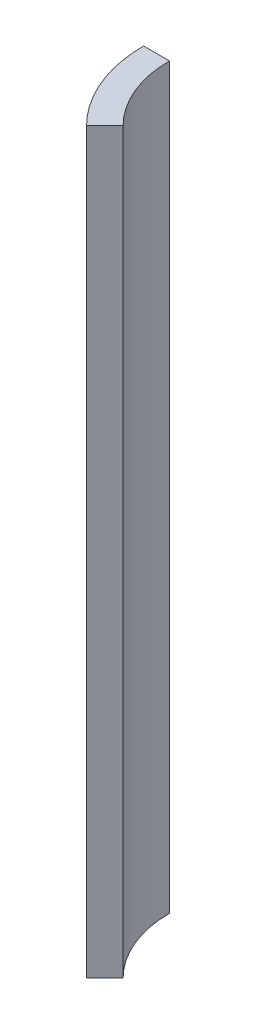
ISO-10303-21;
HEADER;
FILE_DESCRIPTION(('STEP AP214'),'2;1');
FILE_NAME('part.step','',(''),(''),'','','');
FILE_SCHEMA(('AUTOMOTIVE_DESIGN { 1 0 10303 214 1 1 1 1 }'));
ENDSEC;
DATA;
#1=APPLICATION_CONTEXT('core data for automotive mechanical design processes');
#2=APPLICATION_PROTOCOL_DEFINITION('international standard','automotive_design',2000,#1);
#3=PRODUCT_CONTEXT('',#1,'mechanical');
#4=PRODUCT('Part','Part','',(#3));
#5=PRODUCT_RELATED_PRODUCT_CATEGORY('part','',(#4));
#6=PRODUCT_DEFINITION_FORMATION('','',#4);
#7=PRODUCT_DEFINITION_CONTEXT('part definition',#1,'design');
#8=PRODUCT_DEFINITION('design','',#6,#7);
#9=PRODUCT_DEFINITION_SHAPE('','',#8);
#10=(LENGTH_UNIT() NAMED_UNIT(*) SI_UNIT(.MILLI.,.METRE.));
#11=(NAMED_UNIT(*) PLANE_ANGLE_UNIT() SI_UNIT($,.RADIAN.));
#12=(NAMED_UNIT(*) SI_UNIT($,.STERADIAN.) SOLID_ANGLE_UNIT());
#13=UNCERTAINTY_MEASURE_WITH_UNIT(LENGTH_MEASURE(1.E-05),#10,'distance_accuracy_value','');
#14=(GEOMETRIC_REPRESENTATION_CONTEXT(3) GLOBAL_UNCERTAINTY_ASSIGNED_CONTEXT((#13)) GLOBAL_UNIT_ASSIGNED_CONTEXT((#10,
#11,#12)) REPRESENTATION_CONTEXT('',''));
#15=CARTESIAN_POINT('',(0.,0.,0.));
#16=DIRECTION('',(0.,0.,1.));
#17=DIRECTION('',(1.,0.,0.));
#18=AXIS2_PLACEMENT_3D('',#15,#16,#17);
#19=CARTESIAN_POINT('',(0.,544.576,0.));
#20=DIRECTION('',(0.,-1.,0.));
#21=DIRECTION('',(0.,0.,-1.));
#22=AXIS2_PLACEMENT_3D('',#19,#20,#21);
#23=CYLINDRICAL_SURFACE('',#22,101.6);
#24=CARTESIAN_POINT('',(0.,0.,0.));
#25=DIRECTION('',(0.,1.,0.));
#26=DIRECTION('',(0.,0.,1.));
#27=AXIS2_PLACEMENT_3D('',#24,#25,#26);
#28=CIRCLE('',#27,101.6);
#29=CARTESIAN_POINT('',(-101.6,0.,0.));
#30=VERTEX_POINT('',#29);
#31=CARTESIAN_POINT('',(-71.8420489685532,0.,71.8420489685532));
#32=VERTEX_POINT('',#31);
#33=EDGE_CURVE('E96',#30,#32,#28,.T.);
#34=ORIENTED_EDGE('',*,*,#33,.T.);
#35=DIRECTION('',(0.,-1.,0.));
#36=VECTOR('',#35,1.);
#37=CARTESIAN_POINT('',(-71.8420489685532,544.576,71.8420489685532));
#38=LINE('',#37,#36);
#39=CARTESIAN_POINT('',(-71.8420489685532,544.576,71.8420489685532));
#40=VERTEX_POINT('',#39);
#41=EDGE_CURVE('E11',#40,#32,#38,.T.);
#42=ORIENTED_EDGE('',*,*,#41,.F.);
#43=CARTESIAN_POINT('',(0.,544.576,0.));
#44=DIRECTION('',(0.,1.,0.));
#45=DIRECTION('',(0.,0.,1.));
#46=AXIS2_PLACEMENT_3D('',#43,#44,#45);
#47=CIRCLE('',#46,101.6);
#48=CARTESIAN_POINT('',(-101.6,544.576,0.));
#49=VERTEX_POINT('',#48);
#50=EDGE_CURVE('E84',#49,#40,#47,.T.);
#51=ORIENTED_EDGE('',*,*,#50,.F.);
#52=DIRECTION('',(0.,-1.,0.));
#53=VECTOR('',#52,1.);
#54=CARTESIAN_POINT('',(-101.6,544.576,0.));
#55=LINE('',#54,#53);
#56=EDGE_CURVE('E92',#49,#30,#55,.T.);
#57=ORIENTED_EDGE('',*,*,#56,.T.);
#58=EDGE_LOOP('',(#34,#42,#51,#57));
#59=FACE_BOUND('',#58,.T.);
#60=ADVANCED_FACE('F33',(#59),#23,.T.);
#61=CARTESIAN_POINT('',(-58.3716647869495,544.576,58.3716647869495));
#62=DIRECTION('',(-0.707106781186548,0.,-0.707106781186548));
#63=DIRECTION('',(-0.707106781186548,0.,0.707106781186548));
#64=AXIS2_PLACEMENT_3D('',#61,#62,#63);
#65=PLANE('',#64);
#66=DIRECTION('',(0.707106781186547,0.,-0.707106781186547));
#67=VECTOR('',#66,1.);
#68=CARTESIAN_POINT('',(-58.3716647869495,0.,58.3716647869495));
#69=LINE('',#68,#67);
#70=CARTESIAN_POINT('',(-58.3716647869495,0.,58.3716647869495));
#71=VERTEX_POINT('',#70);
#72=EDGE_CURVE('E88',#32,#71,#69,.T.);
#73=ORIENTED_EDGE('',*,*,#72,.T.);
#74=DIRECTION('',(0.,-1.,0.));
#75=VECTOR('',#74,1.);
#76=CARTESIAN_POINT('',(-58.3716647869495,544.576,58.3716647869495));
#77=LINE('',#76,#75);
#78=CARTESIAN_POINT('',(-58.3716647869495,544.576,58.3716647869495));
#79=VERTEX_POINT('',#78);
#80=EDGE_CURVE('E41',#79,#71,#77,.T.);
#81=ORIENTED_EDGE('',*,*,#80,.F.);
#82=DIRECTION('',(0.707106781186547,0.,-0.707106781186547));
#83=VECTOR('',#82,1.);
#84=CARTESIAN_POINT('',(-58.3716647869495,544.576,58.3716647869495));
#85=LINE('',#84,#83);
#86=EDGE_CURVE('E79',#40,#79,#85,.T.);
#87=ORIENTED_EDGE('',*,*,#86,.F.);
#88=ORIENTED_EDGE('',*,*,#41,.T.);
#89=EDGE_LOOP('',(#73,#81,#87,#88));
#90=FACE_BOUND('',#89,.T.);
#91=ADVANCED_FACE('F87',(#90),#65,.F.);
#92=CARTESIAN_POINT('',(0.,544.576,0.));
#93=DIRECTION('',(0.,-1.,0.));
#94=DIRECTION('',(0.,0.,-1.));
#95=AXIS2_PLACEMENT_3D('',#92,#93,#94);
#96=CYLINDRICAL_SURFACE('',#95,82.55);
#97=CARTESIAN_POINT('',(0.,0.,0.));
#98=DIRECTION('',(0.,-1.,0.));
#99=DIRECTION('',(0.,0.,1.));
#100=AXIS2_PLACEMENT_3D('',#97,#98,#99);
#101=CIRCLE('',#100,82.55);
#102=CARTESIAN_POINT('',(-82.55,0.,0.));
#103=VERTEX_POINT('',#102);
#104=EDGE_CURVE('E66',#71,#103,#101,.T.);
#105=ORIENTED_EDGE('',*,*,#104,.T.);
#106=DIRECTION('',(0.,-1.,0.));
#107=VECTOR('',#106,1.);
#108=CARTESIAN_POINT('',(-82.55,544.576,0.));
#109=LINE('',#108,#107);
#110=CARTESIAN_POINT('',(-82.55,544.576,0.));
#111=VERTEX_POINT('',#110);
#112=EDGE_CURVE('E89',#111,#103,#109,.T.);
#113=ORIENTED_EDGE('',*,*,#112,.F.);
#114=CARTESIAN_POINT('',(0.,544.576,0.));
#115=DIRECTION('',(0.,-1.,0.));
#116=DIRECTION('',(0.,0.,1.));
#117=AXIS2_PLACEMENT_3D('',#114,#115,#116);
#118=CIRCLE('',#117,82.55);
#119=EDGE_CURVE('E82',#79,#111,#118,.T.);
#120=ORIENTED_EDGE('',*,*,#119,.F.);
#121=ORIENTED_EDGE('',*,*,#80,.T.);
#122=EDGE_LOOP('',(#105,#113,#120,#121));
#123=FACE_BOUND('',#122,.T.);
#124=ADVANCED_FACE('F90',(#123),#96,.F.);
#125=CARTESIAN_POINT('',(-82.55,544.576,0.));
#126=DIRECTION('',(0.,0.,1.));
#127=DIRECTION('',(1.,0.,0.));
#128=AXIS2_PLACEMENT_3D('',#125,#126,#127);
#129=PLANE('',#128);
#130=DIRECTION('',(-1.,0.,0.));
#131=VECTOR('',#130,1.);
#132=CARTESIAN_POINT('',(-82.55,0.,0.));
#133=LINE('',#132,#131);
#134=EDGE_CURVE('E72',#103,#30,#133,.T.);
#135=ORIENTED_EDGE('',*,*,#134,.T.);
#136=ORIENTED_EDGE('',*,*,#56,.F.);
#137=DIRECTION('',(-1.,0.,0.));
#138=VECTOR('',#137,1.);
#139=CARTESIAN_POINT('',(-82.55,544.576,0.));
#140=LINE('',#139,#138);
#141=EDGE_CURVE('E49',#111,#49,#140,.T.);
#142=ORIENTED_EDGE('',*,*,#141,.F.);
#143=ORIENTED_EDGE('',*,*,#112,.T.);
#144=EDGE_LOOP('',(#135,#136,#142,#143));
#145=FACE_BOUND('',#144,.T.);
#146=ADVANCED_FACE('F103',(#145),#129,.F.);
#147=CARTESIAN_POINT('',(0.,544.576,0.));
#148=DIRECTION('',(0.,1.,0.));
#149=DIRECTION('',(0.,0.,1.));
#150=AXIS2_PLACEMENT_3D('',#147,#148,#149);
#151=PLANE('',#150);
#152=ORIENTED_EDGE('',*,*,#50,.T.);
#153=ORIENTED_EDGE('',*,*,#86,.T.);
#154=ORIENTED_EDGE('',*,*,#119,.T.);
#155=ORIENTED_EDGE('',*,*,#141,.T.);
#156=EDGE_LOOP('',(#152,#153,#154,#155));
#157=FACE_BOUND('',#156,.T.);
#158=ADVANCED_FACE('F80',(#157),#151,.T.);
#159=CARTESIAN_POINT('',(0.,0.,0.));
#160=DIRECTION('',(0.,1.,0.));
#161=DIRECTION('',(0.,0.,1.));
#162=AXIS2_PLACEMENT_3D('',#159,#160,#161);
#163=PLANE('',#162);
#164=ORIENTED_EDGE('',*,*,#33,.F.);
#165=ORIENTED_EDGE('',*,*,#134,.F.);
#166=ORIENTED_EDGE('',*,*,#104,.F.);
#167=ORIENTED_EDGE('',*,*,#72,.F.);
#168=EDGE_LOOP('',(#164,#165,#166,#167));
#169=FACE_BOUND('',#168,.T.);
#170=ADVANCED_FACE('F106',(#169),#163,.F.);
#171=CLOSED_SHELL('',(#60,#91,#124,#146,#158,#170));
#172=MANIFOLD_SOLID_BREP('B2',#171);
#173=ADVANCED_BREP_SHAPE_REPRESENTATION('',(#18,#172),#14);
#174=SHAPE_DEFINITION_REPRESENTATION(#9,#173);
ENDSEC;
END-ISO-10303-21;
